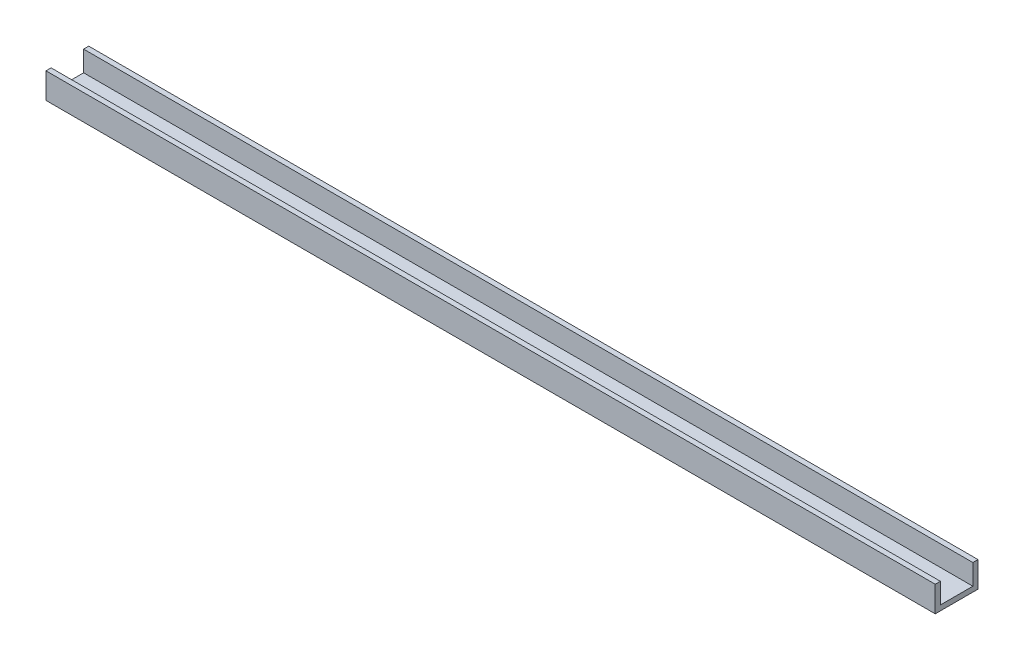
ISO-10303-21;
HEADER;
FILE_DESCRIPTION(('STEP AP214'),'2;1');
FILE_NAME('part.step','',(''),(''),'','','');
FILE_SCHEMA(('AUTOMOTIVE_DESIGN { 1 0 10303 214 1 1 1 1 }'));
ENDSEC;
DATA;
#1=APPLICATION_CONTEXT('core data for automotive mechanical design processes');
#2=APPLICATION_PROTOCOL_DEFINITION('international standard','automotive_design',2000,#1);
#3=PRODUCT_CONTEXT('',#1,'mechanical');
#4=PRODUCT('Part','Part','',(#3));
#5=PRODUCT_RELATED_PRODUCT_CATEGORY('part','',(#4));
#6=PRODUCT_DEFINITION_FORMATION('','',#4);
#7=PRODUCT_DEFINITION_CONTEXT('part definition',#1,'design');
#8=PRODUCT_DEFINITION('design','',#6,#7);
#9=PRODUCT_DEFINITION_SHAPE('','',#8);
#10=(LENGTH_UNIT() NAMED_UNIT(*) SI_UNIT(.MILLI.,.METRE.));
#11=(NAMED_UNIT(*) PLANE_ANGLE_UNIT() SI_UNIT($,.RADIAN.));
#12=(NAMED_UNIT(*) SI_UNIT($,.STERADIAN.) SOLID_ANGLE_UNIT());
#13=UNCERTAINTY_MEASURE_WITH_UNIT(LENGTH_MEASURE(1.E-05),#10,'distance_accuracy_value','');
#14=(GEOMETRIC_REPRESENTATION_CONTEXT(3) GLOBAL_UNCERTAINTY_ASSIGNED_CONTEXT((#13)) GLOBAL_UNIT_ASSIGNED_CONTEXT((#10,
#11,#12)) REPRESENTATION_CONTEXT('',''));
#15=CARTESIAN_POINT('',(0.,0.,0.));
#16=DIRECTION('',(0.,0.,1.));
#17=DIRECTION('',(1.,0.,0.));
#18=AXIS2_PLACEMENT_3D('',#15,#16,#17);
#19=CARTESIAN_POINT('',(520.,0.,9.5));
#20=DIRECTION('',(0.,0.,1.));
#21=DIRECTION('',(1.,0.,0.));
#22=AXIS2_PLACEMENT_3D('',#19,#20,#21);
#23=PLANE('',#22);
#24=DIRECTION('',(0.,1.,0.));
#25=VECTOR('',#24,1.);
#26=CARTESIAN_POINT('',(0.,0.,9.5));
#27=LINE('',#26,#25);
#28=CARTESIAN_POINT('',(0.,3.,9.5));
#29=VERTEX_POINT('',#28);
#30=CARTESIAN_POINT('',(0.,15.,9.5));
#31=VERTEX_POINT('',#30);
#32=EDGE_CURVE('E134',#29,#31,#27,.T.);
#33=ORIENTED_EDGE('',*,*,#32,.T.);
#34=DIRECTION('',(-1.,0.,0.));
#35=VECTOR('',#34,1.);
#36=CARTESIAN_POINT('',(520.,15.,9.5));
#37=LINE('',#36,#35);
#38=CARTESIAN_POINT('',(520.,15.,9.5));
#39=VERTEX_POINT('',#38);
#40=EDGE_CURVE('E11',#39,#31,#37,.T.);
#41=ORIENTED_EDGE('',*,*,#40,.F.);
#42=DIRECTION('',(0.,1.,0.));
#43=VECTOR('',#42,1.);
#44=CARTESIAN_POINT('',(520.,0.,9.5));
#45=LINE('',#44,#43);
#46=CARTESIAN_POINT('',(520.,3.,9.5));
#47=VERTEX_POINT('',#46);
#48=EDGE_CURVE('E92',#47,#39,#45,.T.);
#49=ORIENTED_EDGE('',*,*,#48,.F.);
#50=DIRECTION('',(-1.,0.,0.));
#51=VECTOR('',#50,1.);
#52=CARTESIAN_POINT('',(520.,3.,9.5));
#53=LINE('',#52,#51);
#54=EDGE_CURVE('E133',#47,#29,#53,.T.);
#55=ORIENTED_EDGE('',*,*,#54,.T.);
#56=EDGE_LOOP('',(#33,#41,#49,#55));
#57=FACE_BOUND('',#56,.T.);
#58=ADVANCED_FACE('F37',(#57),#23,.F.);
#59=CARTESIAN_POINT('',(520.,15.,12.5));
#60=DIRECTION('',(0.,1.,0.));
#61=DIRECTION('',(0.,0.,1.));
#62=AXIS2_PLACEMENT_3D('',#59,#60,#61);
#63=PLANE('',#62);
#64=DIRECTION('',(0.,0.,-1.));
#65=VECTOR('',#64,1.);
#66=CARTESIAN_POINT('',(0.,15.,12.5));
#67=LINE('',#66,#65);
#68=CARTESIAN_POINT('',(0.,15.,12.5));
#69=VERTEX_POINT('',#68);
#70=EDGE_CURVE('E137',#69,#31,#67,.T.);
#71=ORIENTED_EDGE('',*,*,#70,.F.);
#72=DIRECTION('',(-1.,0.,0.));
#73=VECTOR('',#72,1.);
#74=CARTESIAN_POINT('',(520.,15.,12.5));
#75=LINE('',#74,#73);
#76=CARTESIAN_POINT('',(520.,15.,12.5));
#77=VERTEX_POINT('',#76);
#78=EDGE_CURVE('E45',#77,#69,#75,.T.);
#79=ORIENTED_EDGE('',*,*,#78,.F.);
#80=DIRECTION('',(0.,0.,-1.));
#81=VECTOR('',#80,1.);
#82=CARTESIAN_POINT('',(520.,15.,12.5));
#83=LINE('',#82,#81);
#84=EDGE_CURVE('E176',#77,#39,#83,.T.);
#85=ORIENTED_EDGE('',*,*,#84,.T.);
#86=ORIENTED_EDGE('',*,*,#40,.T.);
#87=EDGE_LOOP('',(#71,#79,#85,#86));
#88=FACE_BOUND('',#87,.T.);
#89=ADVANCED_FACE('F167',(#88),#63,.T.);
#90=CARTESIAN_POINT('',(520.,0.,12.5));
#91=DIRECTION('',(0.,0.,1.));
#92=DIRECTION('',(1.,0.,0.));
#93=AXIS2_PLACEMENT_3D('',#90,#91,#92);
#94=PLANE('',#93);
#95=DIRECTION('',(0.,1.,0.));
#96=VECTOR('',#95,1.);
#97=CARTESIAN_POINT('',(0.,0.,12.5));
#98=LINE('',#97,#96);
#99=CARTESIAN_POINT('',(0.,0.,12.5));
#100=VERTEX_POINT('',#99);
#101=EDGE_CURVE('E140',#100,#69,#98,.T.);
#102=ORIENTED_EDGE('',*,*,#101,.F.);
#103=DIRECTION('',(-1.,0.,0.));
#104=VECTOR('',#103,1.);
#105=CARTESIAN_POINT('',(520.,0.,12.5));
#106=LINE('',#105,#104);
#107=CARTESIAN_POINT('',(520.,0.,12.5));
#108=VERTEX_POINT('',#107);
#109=EDGE_CURVE('E157',#108,#100,#106,.T.);
#110=ORIENTED_EDGE('',*,*,#109,.F.);
#111=DIRECTION('',(0.,1.,0.));
#112=VECTOR('',#111,1.);
#113=CARTESIAN_POINT('',(520.,0.,12.5));
#114=LINE('',#113,#112);
#115=EDGE_CURVE('E164',#108,#77,#114,.T.);
#116=ORIENTED_EDGE('',*,*,#115,.T.);
#117=ORIENTED_EDGE('',*,*,#78,.T.);
#118=EDGE_LOOP('',(#102,#110,#116,#117));
#119=FACE_BOUND('',#118,.T.);
#120=ADVANCED_FACE('F162',(#119),#94,.T.);
#121=CARTESIAN_POINT('',(520.,0.,12.5));
#122=DIRECTION('',(0.,-1.,0.));
#123=DIRECTION('',(0.,0.,-1.));
#124=AXIS2_PLACEMENT_3D('',#121,#122,#123);
#125=PLANE('',#124);
#126=DIRECTION('',(0.,0.,1.));
#127=VECTOR('',#126,1.);
#128=CARTESIAN_POINT('',(0.,0.,12.5));
#129=LINE('',#128,#127);
#130=CARTESIAN_POINT('',(0.,0.,-12.5));
#131=VERTEX_POINT('',#130);
#132=EDGE_CURVE('E143',#131,#100,#129,.T.);
#133=ORIENTED_EDGE('',*,*,#132,.F.);
#134=DIRECTION('',(-1.,0.,0.));
#135=VECTOR('',#134,1.);
#136=CARTESIAN_POINT('',(520.,0.,-12.5));
#137=LINE('',#136,#135);
#138=CARTESIAN_POINT('',(520.,0.,-12.5));
#139=VERTEX_POINT('',#138);
#140=EDGE_CURVE('E155',#139,#131,#137,.T.);
#141=ORIENTED_EDGE('',*,*,#140,.F.);
#142=DIRECTION('',(0.,0.,1.));
#143=VECTOR('',#142,1.);
#144=CARTESIAN_POINT('',(520.,0.,12.5));
#145=LINE('',#144,#143);
#146=EDGE_CURVE('E128',#139,#108,#145,.T.);
#147=ORIENTED_EDGE('',*,*,#146,.T.);
#148=ORIENTED_EDGE('',*,*,#109,.T.);
#149=EDGE_LOOP('',(#133,#141,#147,#148));
#150=FACE_BOUND('',#149,.T.);
#151=ADVANCED_FACE('F174',(#150),#125,.T.);
#152=CARTESIAN_POINT('',(520.,0.,-12.5));
#153=DIRECTION('',(0.,0.,-1.));
#154=DIRECTION('',(-1.,0.,0.));
#155=AXIS2_PLACEMENT_3D('',#152,#153,#154);
#156=PLANE('',#155);
#157=DIRECTION('',(0.,-1.,0.));
#158=VECTOR('',#157,1.);
#159=CARTESIAN_POINT('',(0.,0.,-12.5));
#160=LINE('',#159,#158);
#161=CARTESIAN_POINT('',(0.,15.,-12.5));
#162=VERTEX_POINT('',#161);
#163=EDGE_CURVE('E146',#162,#131,#160,.T.);
#164=ORIENTED_EDGE('',*,*,#163,.F.);
#165=DIRECTION('',(-1.,0.,0.));
#166=VECTOR('',#165,1.);
#167=CARTESIAN_POINT('',(520.,15.,-12.5));
#168=LINE('',#167,#166);
#169=CARTESIAN_POINT('',(520.,15.,-12.5));
#170=VERTEX_POINT('',#169);
#171=EDGE_CURVE('E116',#170,#162,#168,.T.);
#172=ORIENTED_EDGE('',*,*,#171,.F.);
#173=DIRECTION('',(0.,-1.,0.));
#174=VECTOR('',#173,1.);
#175=CARTESIAN_POINT('',(520.,0.,-12.5));
#176=LINE('',#175,#174);
#177=EDGE_CURVE('E126',#170,#139,#176,.T.);
#178=ORIENTED_EDGE('',*,*,#177,.T.);
#179=ORIENTED_EDGE('',*,*,#140,.T.);
#180=EDGE_LOOP('',(#164,#172,#178,#179));
#181=FACE_BOUND('',#180,.T.);
#182=ADVANCED_FACE('F181',(#181),#156,.T.);
#183=CARTESIAN_POINT('',(520.,15.,-9.5));
#184=DIRECTION('',(0.,1.,0.));
#185=DIRECTION('',(0.,0.,1.));
#186=AXIS2_PLACEMENT_3D('',#183,#184,#185);
#187=PLANE('',#186);
#188=DIRECTION('',(0.,0.,-1.));
#189=VECTOR('',#188,1.);
#190=CARTESIAN_POINT('',(0.,15.,-9.5));
#191=LINE('',#190,#189);
#192=CARTESIAN_POINT('',(0.,15.,-9.5));
#193=VERTEX_POINT('',#192);
#194=EDGE_CURVE('E115',#193,#162,#191,.T.);
#195=ORIENTED_EDGE('',*,*,#194,.F.);
#196=DIRECTION('',(-1.,0.,0.));
#197=VECTOR('',#196,1.);
#198=CARTESIAN_POINT('',(520.,15.,-9.5));
#199=LINE('',#198,#197);
#200=CARTESIAN_POINT('',(520.,15.,-9.5));
#201=VERTEX_POINT('',#200);
#202=EDGE_CURVE('E109',#201,#193,#199,.T.);
#203=ORIENTED_EDGE('',*,*,#202,.F.);
#204=DIRECTION('',(0.,0.,-1.));
#205=VECTOR('',#204,1.);
#206=CARTESIAN_POINT('',(520.,15.,-9.5));
#207=LINE('',#206,#205);
#208=EDGE_CURVE('E113',#201,#170,#207,.T.);
#209=ORIENTED_EDGE('',*,*,#208,.T.);
#210=ORIENTED_EDGE('',*,*,#171,.T.);
#211=EDGE_LOOP('',(#195,#203,#209,#210));
#212=FACE_BOUND('',#211,.T.);
#213=ADVANCED_FACE('F111',(#212),#187,.T.);
#214=CARTESIAN_POINT('',(520.,0.,-9.5));
#215=DIRECTION('',(0.,0.,-1.));
#216=DIRECTION('',(-1.,0.,0.));
#217=AXIS2_PLACEMENT_3D('',#214,#215,#216);
#218=PLANE('',#217);
#219=DIRECTION('',(0.,1.,0.));
#220=VECTOR('',#219,1.);
#221=CARTESIAN_POINT('',(0.,0.,-9.5));
#222=LINE('',#221,#220);
#223=CARTESIAN_POINT('',(0.,3.,-9.5));
#224=VERTEX_POINT('',#223);
#225=EDGE_CURVE('E80',#193,#224,#222,.F.);
#226=ORIENTED_EDGE('',*,*,#225,.T.);
#227=DIRECTION('',(-1.,0.,0.));
#228=VECTOR('',#227,1.);
#229=CARTESIAN_POINT('',(520.,3.,-9.5));
#230=LINE('',#229,#228);
#231=CARTESIAN_POINT('',(520.,3.,-9.5));
#232=VERTEX_POINT('',#231);
#233=EDGE_CURVE('E117',#232,#224,#230,.T.);
#234=ORIENTED_EDGE('',*,*,#233,.F.);
#235=DIRECTION('',(0.,1.,0.));
#236=VECTOR('',#235,1.);
#237=CARTESIAN_POINT('',(520.,0.,-9.5));
#238=LINE('',#237,#236);
#239=EDGE_CURVE('E119',#201,#232,#238,.F.);
#240=ORIENTED_EDGE('',*,*,#239,.F.);
#241=ORIENTED_EDGE('',*,*,#202,.T.);
#242=EDGE_LOOP('',(#226,#234,#240,#241));
#243=FACE_BOUND('',#242,.T.);
#244=ADVANCED_FACE('F120',(#243),#218,.F.);
#245=CARTESIAN_POINT('',(520.,3.,12.5));
#246=DIRECTION('',(0.,-1.,0.));
#247=DIRECTION('',(0.,0.,-1.));
#248=AXIS2_PLACEMENT_3D('',#245,#246,#247);
#249=PLANE('',#248);
#250=DIRECTION('',(0.,0.,-1.));
#251=VECTOR('',#250,1.);
#252=CARTESIAN_POINT('',(0.,3.,12.5));
#253=LINE('',#252,#251);
#254=EDGE_CURVE('E86',#224,#29,#253,.F.);
#255=ORIENTED_EDGE('',*,*,#254,.T.);
#256=ORIENTED_EDGE('',*,*,#54,.F.);
#257=DIRECTION('',(0.,0.,-1.));
#258=VECTOR('',#257,1.);
#259=CARTESIAN_POINT('',(520.,3.,12.5));
#260=LINE('',#259,#258);
#261=EDGE_CURVE('E53',#232,#47,#260,.F.);
#262=ORIENTED_EDGE('',*,*,#261,.F.);
#263=ORIENTED_EDGE('',*,*,#233,.T.);
#264=EDGE_LOOP('',(#255,#256,#262,#263));
#265=FACE_BOUND('',#264,.T.);
#266=ADVANCED_FACE('F183',(#265),#249,.F.);
#267=CARTESIAN_POINT('',(520.,0.,0.));
#268=DIRECTION('',(-1.,0.,0.));
#269=DIRECTION('',(0.,0.,1.));
#270=AXIS2_PLACEMENT_3D('',#267,#268,#269);
#271=PLANE('',#270);
#272=ORIENTED_EDGE('',*,*,#48,.T.);
#273=ORIENTED_EDGE('',*,*,#84,.F.);
#274=ORIENTED_EDGE('',*,*,#115,.F.);
#275=ORIENTED_EDGE('',*,*,#146,.F.);
#276=ORIENTED_EDGE('',*,*,#177,.F.);
#277=ORIENTED_EDGE('',*,*,#208,.F.);
#278=ORIENTED_EDGE('',*,*,#239,.T.);
#279=ORIENTED_EDGE('',*,*,#261,.T.);
#280=EDGE_LOOP('',(#272,#273,#274,#275,#276,#277,#278,#279));
#281=FACE_BOUND('',#280,.T.);
#282=ADVANCED_FACE('F123',(#281),#271,.F.);
#283=CARTESIAN_POINT('',(0.,0.,0.));
#284=DIRECTION('',(-1.,0.,0.));
#285=DIRECTION('',(0.,0.,1.));
#286=AXIS2_PLACEMENT_3D('',#283,#284,#285);
#287=PLANE('',#286);
#288=ORIENTED_EDGE('',*,*,#32,.F.);
#289=ORIENTED_EDGE('',*,*,#254,.F.);
#290=ORIENTED_EDGE('',*,*,#225,.F.);
#291=ORIENTED_EDGE('',*,*,#194,.T.);
#292=ORIENTED_EDGE('',*,*,#163,.T.);
#293=ORIENTED_EDGE('',*,*,#132,.T.);
#294=ORIENTED_EDGE('',*,*,#101,.T.);
#295=ORIENTED_EDGE('',*,*,#70,.T.);
#296=EDGE_LOOP('',(#288,#289,#290,#291,#292,#293,#294,#295));
#297=FACE_BOUND('',#296,.T.);
#298=ADVANCED_FACE('F170',(#297),#287,.T.);
#299=CLOSED_SHELL('',(#58,#89,#120,#151,#182,#213,#244,#266,#282,#298));
#300=MANIFOLD_SOLID_BREP('B2',#299);
#301=ADVANCED_BREP_SHAPE_REPRESENTATION('',(#18,#300),#14);
#302=SHAPE_DEFINITION_REPRESENTATION(#9,#301);
ENDSEC;
END-ISO-10303-21;
